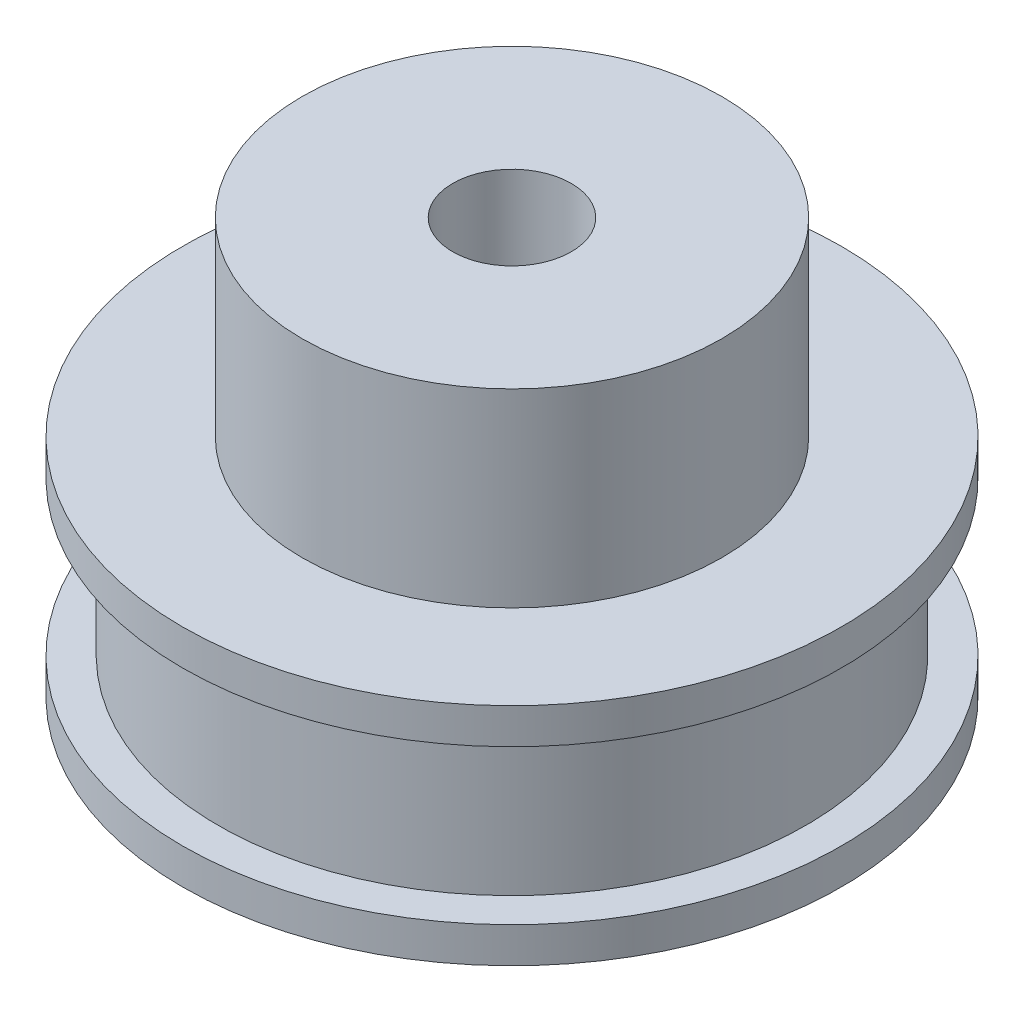
ISO-10303-21;
HEADER;
FILE_DESCRIPTION(('STEP AP214'),'2;1');
FILE_NAME('part.step','',(''),(''),'','','');
FILE_SCHEMA(('AUTOMOTIVE_DESIGN { 1 0 10303 214 1 1 1 1 }'));
ENDSEC;
DATA;
#1=APPLICATION_CONTEXT('core data for automotive mechanical design processes');
#2=APPLICATION_PROTOCOL_DEFINITION('international standard','automotive_design',2000,#1);
#3=PRODUCT_CONTEXT('',#1,'mechanical');
#4=PRODUCT('Part','Part','',(#3));
#5=PRODUCT_RELATED_PRODUCT_CATEGORY('part','',(#4));
#6=PRODUCT_DEFINITION_FORMATION('','',#4);
#7=PRODUCT_DEFINITION_CONTEXT('part definition',#1,'design');
#8=PRODUCT_DEFINITION('design','',#6,#7);
#9=PRODUCT_DEFINITION_SHAPE('','',#8);
#10=(LENGTH_UNIT() NAMED_UNIT(*) SI_UNIT(.MILLI.,.METRE.));
#11=(NAMED_UNIT(*) PLANE_ANGLE_UNIT() SI_UNIT($,.RADIAN.));
#12=(NAMED_UNIT(*) SI_UNIT($,.STERADIAN.) SOLID_ANGLE_UNIT());
#13=UNCERTAINTY_MEASURE_WITH_UNIT(LENGTH_MEASURE(1.E-05),#10,'distance_accuracy_value','');
#14=(GEOMETRIC_REPRESENTATION_CONTEXT(3) GLOBAL_UNCERTAINTY_ASSIGNED_CONTEXT((#13)) GLOBAL_UNIT_ASSIGNED_CONTEXT((#10,
#11,#12)) REPRESENTATION_CONTEXT('',''));
#15=CARTESIAN_POINT('',(0.,0.,0.));
#16=DIRECTION('',(0.,0.,1.));
#17=DIRECTION('',(1.,0.,0.));
#18=AXIS2_PLACEMENT_3D('',#15,#16,#17);
#19=CARTESIAN_POINT('',(0.,0.,0.));
#20=DIRECTION('',(0.,-1.,0.));
#21=DIRECTION('',(0.,0.,-1.));
#22=AXIS2_PLACEMENT_3D('',#19,#20,#21);
#23=CYLINDRICAL_SURFACE('',#22,2.5);
#24=CARTESIAN_POINT('',(0.,0.,0.));
#25=DIRECTION('',(0.,-1.,0.));
#26=DIRECTION('',(0.,0.,-1.));
#27=AXIS2_PLACEMENT_3D('',#24,#25,#26);
#28=CIRCLE('',#27,2.5);
#29=CARTESIAN_POINT('',(0.,0.,-2.5));
#30=VERTEX_POINT('',#29);
#31=EDGE_CURVE('E10',#30,#30,#28,.T.);
#32=ORIENTED_EDGE('',*,*,#31,.T.);
#33=EDGE_LOOP('',(#32));
#34=FACE_BOUND('',#33,.T.);
#35=CARTESIAN_POINT('',(0.,17.5,0.));
#36=DIRECTION('',(0.,-1.,0.));
#37=DIRECTION('',(0.,0.,-1.));
#38=AXIS2_PLACEMENT_3D('',#35,#36,#37);
#39=CIRCLE('',#38,2.5);
#40=CARTESIAN_POINT('',(0.,17.5,-2.5));
#41=VERTEX_POINT('',#40);
#42=EDGE_CURVE('E64',#41,#41,#39,.T.);
#43=ORIENTED_EDGE('',*,*,#42,.F.);
#44=EDGE_LOOP('',(#43));
#45=FACE_BOUND('',#44,.T.);
#46=ADVANCED_FACE('F30',(#34,#45),#23,.F.);
#47=CARTESIAN_POINT('',(2.5,0.,0.));
#48=DIRECTION('',(0.,-1.,0.));
#49=DIRECTION('',(0.,0.,-1.));
#50=AXIS2_PLACEMENT_3D('',#47,#48,#49);
#51=PLANE('',#50);
#52=CARTESIAN_POINT('',(0.,0.,0.));
#53=DIRECTION('',(0.,-1.,0.));
#54=DIRECTION('',(0.,0.,-1.));
#55=AXIS2_PLACEMENT_3D('',#52,#53,#54);
#56=CIRCLE('',#55,13.9);
#57=CARTESIAN_POINT('',(0.,0.,-13.9));
#58=VERTEX_POINT('',#57);
#59=EDGE_CURVE('E36',#58,#58,#56,.T.);
#60=ORIENTED_EDGE('',*,*,#59,.T.);
#61=EDGE_LOOP('',(#60));
#62=FACE_BOUND('',#61,.T.);
#63=ORIENTED_EDGE('',*,*,#31,.F.);
#64=EDGE_LOOP('',(#63));
#65=FACE_BOUND('',#64,.T.);
#66=ADVANCED_FACE('F72',(#62,#65),#51,.T.);
#67=CARTESIAN_POINT('',(0.,0.,0.));
#68=DIRECTION('',(0.,-1.,0.));
#69=DIRECTION('',(0.,0.,-1.));
#70=AXIS2_PLACEMENT_3D('',#67,#68,#69);
#71=CYLINDRICAL_SURFACE('',#70,13.9);
#72=CARTESIAN_POINT('',(0.,1.5,0.));
#73=DIRECTION('',(0.,-1.,0.));
#74=DIRECTION('',(0.,0.,-1.));
#75=AXIS2_PLACEMENT_3D('',#72,#73,#74);
#76=CIRCLE('',#75,13.9);
#77=CARTESIAN_POINT('',(0.,1.5,-13.9));
#78=VERTEX_POINT('',#77);
#79=EDGE_CURVE('E40',#78,#78,#76,.T.);
#80=ORIENTED_EDGE('',*,*,#79,.T.);
#81=EDGE_LOOP('',(#80));
#82=FACE_BOUND('',#81,.T.);
#83=ORIENTED_EDGE('',*,*,#59,.F.);
#84=EDGE_LOOP('',(#83));
#85=FACE_BOUND('',#84,.T.);
#86=ADVANCED_FACE('F76',(#82,#85),#71,.T.);
#87=CARTESIAN_POINT('',(13.9,1.5,0.));
#88=DIRECTION('',(0.,1.,0.));
#89=DIRECTION('',(0.,0.,1.));
#90=AXIS2_PLACEMENT_3D('',#87,#88,#89);
#91=PLANE('',#90);
#92=CARTESIAN_POINT('',(0.,1.5,0.));
#93=DIRECTION('',(0.,-1.,0.));
#94=DIRECTION('',(0.,0.,-1.));
#95=AXIS2_PLACEMENT_3D('',#92,#93,#94);
#96=CIRCLE('',#95,12.4);
#97=CARTESIAN_POINT('',(0.,1.5,-12.4));
#98=VERTEX_POINT('',#97);
#99=EDGE_CURVE('E44',#98,#98,#96,.T.);
#100=ORIENTED_EDGE('',*,*,#99,.T.);
#101=EDGE_LOOP('',(#100));
#102=FACE_BOUND('',#101,.T.);
#103=ORIENTED_EDGE('',*,*,#79,.F.);
#104=EDGE_LOOP('',(#103));
#105=FACE_BOUND('',#104,.T.);
#106=ADVANCED_FACE('F80',(#102,#105),#91,.T.);
#107=CARTESIAN_POINT('',(0.,0.,0.));
#108=DIRECTION('',(0.,-1.,0.));
#109=DIRECTION('',(0.,0.,-1.));
#110=AXIS2_PLACEMENT_3D('',#107,#108,#109);
#111=CYLINDRICAL_SURFACE('',#110,12.4);
#112=CARTESIAN_POINT('',(0.,8.,0.));
#113=DIRECTION('',(0.,-1.,0.));
#114=DIRECTION('',(0.,0.,-1.));
#115=AXIS2_PLACEMENT_3D('',#112,#113,#114);
#116=CIRCLE('',#115,12.4);
#117=CARTESIAN_POINT('',(0.,8.,-12.4));
#118=VERTEX_POINT('',#117);
#119=EDGE_CURVE('E49',#118,#118,#116,.T.);
#120=ORIENTED_EDGE('',*,*,#119,.T.);
#121=EDGE_LOOP('',(#120));
#122=FACE_BOUND('',#121,.T.);
#123=ORIENTED_EDGE('',*,*,#99,.F.);
#124=EDGE_LOOP('',(#123));
#125=FACE_BOUND('',#124,.T.);
#126=ADVANCED_FACE('F87',(#122,#125),#111,.T.);
#127=CARTESIAN_POINT('',(12.4,8.,0.));
#128=DIRECTION('',(0.,-1.,0.));
#129=DIRECTION('',(0.,0.,-1.));
#130=AXIS2_PLACEMENT_3D('',#127,#128,#129);
#131=PLANE('',#130);
#132=CARTESIAN_POINT('',(0.,8.,0.));
#133=DIRECTION('',(0.,-1.,0.));
#134=DIRECTION('',(0.,0.,-1.));
#135=AXIS2_PLACEMENT_3D('',#132,#133,#134);
#136=CIRCLE('',#135,13.9);
#137=CARTESIAN_POINT('',(0.,8.,-13.9));
#138=VERTEX_POINT('',#137);
#139=EDGE_CURVE('E52',#138,#138,#136,.T.);
#140=ORIENTED_EDGE('',*,*,#139,.T.);
#141=EDGE_LOOP('',(#140));
#142=FACE_BOUND('',#141,.T.);
#143=ORIENTED_EDGE('',*,*,#119,.F.);
#144=EDGE_LOOP('',(#143));
#145=FACE_BOUND('',#144,.T.);
#146=ADVANCED_FACE('F91',(#142,#145),#131,.T.);
#147=CARTESIAN_POINT('',(0.,0.,0.));
#148=DIRECTION('',(0.,-1.,0.));
#149=DIRECTION('',(0.,0.,-1.));
#150=AXIS2_PLACEMENT_3D('',#147,#148,#149);
#151=CYLINDRICAL_SURFACE('',#150,13.9);
#152=CARTESIAN_POINT('',(0.,9.5,0.));
#153=DIRECTION('',(0.,-1.,0.));
#154=DIRECTION('',(0.,0.,-1.));
#155=AXIS2_PLACEMENT_3D('',#152,#153,#154);
#156=CIRCLE('',#155,13.9);
#157=CARTESIAN_POINT('',(0.,9.5,-13.9));
#158=VERTEX_POINT('',#157);
#159=EDGE_CURVE('E55',#158,#158,#156,.T.);
#160=ORIENTED_EDGE('',*,*,#159,.T.);
#161=EDGE_LOOP('',(#160));
#162=FACE_BOUND('',#161,.T.);
#163=ORIENTED_EDGE('',*,*,#139,.F.);
#164=EDGE_LOOP('',(#163));
#165=FACE_BOUND('',#164,.T.);
#166=ADVANCED_FACE('F95',(#162,#165),#151,.T.);
#167=CARTESIAN_POINT('',(13.9,9.5,0.));
#168=DIRECTION('',(0.,1.,0.));
#169=DIRECTION('',(0.,0.,1.));
#170=AXIS2_PLACEMENT_3D('',#167,#168,#169);
#171=PLANE('',#170);
#172=CARTESIAN_POINT('',(0.,9.5,0.));
#173=DIRECTION('',(0.,-1.,0.));
#174=DIRECTION('',(0.,0.,-1.));
#175=AXIS2_PLACEMENT_3D('',#172,#173,#174);
#176=CIRCLE('',#175,8.85);
#177=CARTESIAN_POINT('',(0.,9.5,-8.85));
#178=VERTEX_POINT('',#177);
#179=EDGE_CURVE('E58',#178,#178,#176,.T.);
#180=ORIENTED_EDGE('',*,*,#179,.T.);
#181=EDGE_LOOP('',(#180));
#182=FACE_BOUND('',#181,.T.);
#183=ORIENTED_EDGE('',*,*,#159,.F.);
#184=EDGE_LOOP('',(#183));
#185=FACE_BOUND('',#184,.T.);
#186=ADVANCED_FACE('F99',(#182,#185),#171,.T.);
#187=CARTESIAN_POINT('',(0.,0.,0.));
#188=DIRECTION('',(0.,-1.,0.));
#189=DIRECTION('',(0.,0.,-1.));
#190=AXIS2_PLACEMENT_3D('',#187,#188,#189);
#191=CYLINDRICAL_SURFACE('',#190,8.85);
#192=CARTESIAN_POINT('',(0.,17.5,0.));
#193=DIRECTION('',(0.,-1.,0.));
#194=DIRECTION('',(0.,0.,-1.));
#195=AXIS2_PLACEMENT_3D('',#192,#193,#194);
#196=CIRCLE('',#195,8.85);
#197=CARTESIAN_POINT('',(0.,17.5,-8.85));
#198=VERTEX_POINT('',#197);
#199=EDGE_CURVE('E61',#198,#198,#196,.T.);
#200=ORIENTED_EDGE('',*,*,#199,.T.);
#201=EDGE_LOOP('',(#200));
#202=FACE_BOUND('',#201,.T.);
#203=ORIENTED_EDGE('',*,*,#179,.F.);
#204=EDGE_LOOP('',(#203));
#205=FACE_BOUND('',#204,.T.);
#206=ADVANCED_FACE('F103',(#202,#205),#191,.T.);
#207=CARTESIAN_POINT('',(8.85,17.5,0.));
#208=DIRECTION('',(0.,1.,0.));
#209=DIRECTION('',(0.,0.,1.));
#210=AXIS2_PLACEMENT_3D('',#207,#208,#209);
#211=PLANE('',#210);
#212=ORIENTED_EDGE('',*,*,#42,.T.);
#213=EDGE_LOOP('',(#212));
#214=FACE_BOUND('',#213,.T.);
#215=ORIENTED_EDGE('',*,*,#199,.F.);
#216=EDGE_LOOP('',(#215));
#217=FACE_BOUND('',#216,.T.);
#218=ADVANCED_FACE('F68',(#214,#217),#211,.T.);
#219=CLOSED_SHELL('',(#46,#66,#86,#106,#126,#146,#166,#186,#206,#218));
#220=MANIFOLD_SOLID_BREP('B2',#219);
#221=ADVANCED_BREP_SHAPE_REPRESENTATION('',(#18,#220),#14);
#222=SHAPE_DEFINITION_REPRESENTATION(#9,#221);
ENDSEC;
END-ISO-10303-21;
